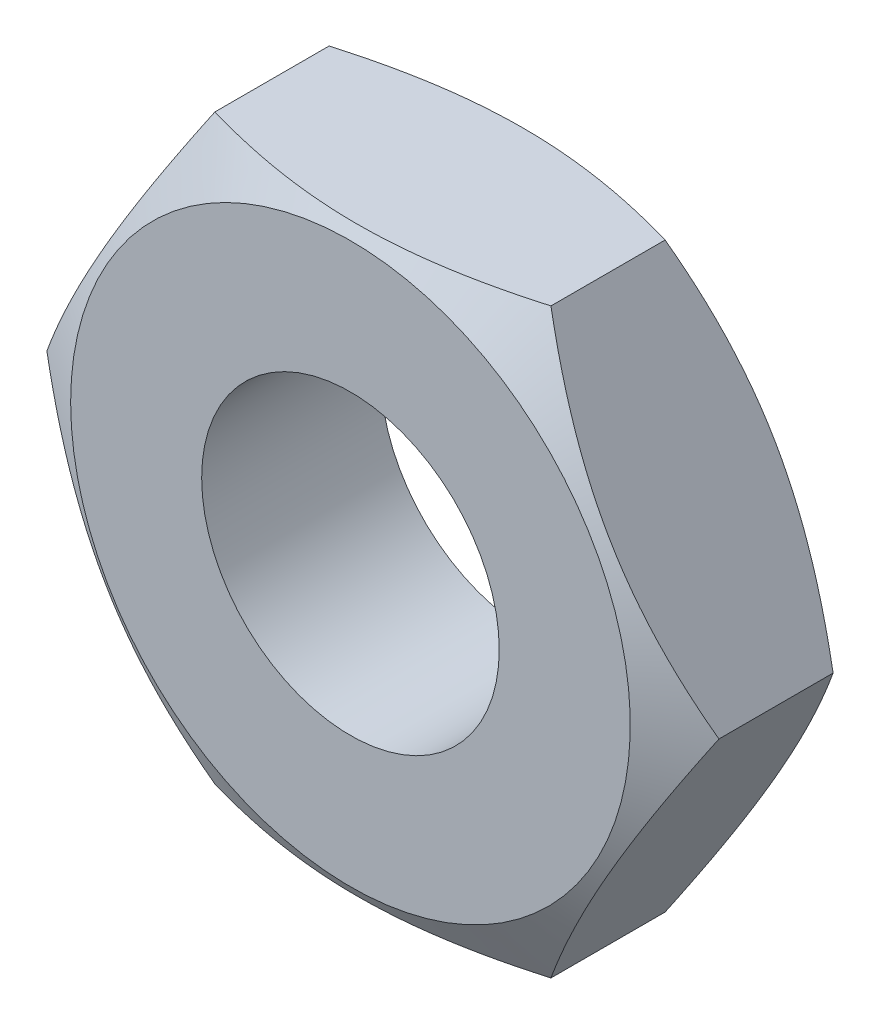
ISO-10303-21;
HEADER;
FILE_DESCRIPTION(('STEP AP214'),'2;1');
FILE_NAME('part.step','',(''),(''),'','','');
FILE_SCHEMA(('AUTOMOTIVE_DESIGN { 1 0 10303 214 1 1 1 1 }'));
ENDSEC;
DATA;
#1=APPLICATION_CONTEXT('core data for automotive mechanical design processes');
#2=APPLICATION_PROTOCOL_DEFINITION('international standard','automotive_design',2000,#1);
#3=PRODUCT_CONTEXT('',#1,'mechanical');
#4=PRODUCT('Part','Part','',(#3));
#5=PRODUCT_RELATED_PRODUCT_CATEGORY('part','',(#4));
#6=PRODUCT_DEFINITION_FORMATION('','',#4);
#7=PRODUCT_DEFINITION_CONTEXT('part definition',#1,'design');
#8=PRODUCT_DEFINITION('design','',#6,#7);
#9=PRODUCT_DEFINITION_SHAPE('','',#8);
#10=(LENGTH_UNIT() NAMED_UNIT(*) SI_UNIT(.MILLI.,.METRE.));
#11=(NAMED_UNIT(*) PLANE_ANGLE_UNIT() SI_UNIT($,.RADIAN.));
#12=(NAMED_UNIT(*) SI_UNIT($,.STERADIAN.) SOLID_ANGLE_UNIT());
#13=UNCERTAINTY_MEASURE_WITH_UNIT(LENGTH_MEASURE(1.E-05),#10,'distance_accuracy_value','');
#14=(GEOMETRIC_REPRESENTATION_CONTEXT(3) GLOBAL_UNCERTAINTY_ASSIGNED_CONTEXT((#13)) GLOBAL_UNIT_ASSIGNED_CONTEXT((#10,
#11,#12)) REPRESENTATION_CONTEXT('',''));
#15=CARTESIAN_POINT('',(0.,0.,0.));
#16=DIRECTION('',(0.,0.,1.));
#17=DIRECTION('',(1.,0.,0.));
#18=AXIS2_PLACEMENT_3D('',#15,#16,#17);
#19=CARTESIAN_POINT('',(-3.75277674973259,-6.5,3.99999999999992));
#20=DIRECTION('',(-0.866025403784438,-0.500000000000001,0.));
#21=DIRECTION('',(0.500000000000001,-0.866025403784438,0.));
#22=AXIS2_PLACEMENT_3D('',#19,#20,#21);
#23=PLANE('',#22);
#24=DIRECTION('',(0.,0.,-1.));
#25=VECTOR('',#24,1.);
#26=CARTESIAN_POINT('',(-3.75277674973259,-6.5,3.99999999999992));
#27=LINE('',#26,#25);
#28=CARTESIAN_POINT('',(-3.75277674973261,-6.5,3.27510584910175));
#29=VERTEX_POINT('',#28);
#30=CARTESIAN_POINT('',(-3.7527767497326,-6.50000000000001,0.724894150898089));
#31=VERTEX_POINT('',#30);
#32=EDGE_CURVE('E11',#29,#31,#27,.T.);
#33=ORIENTED_EDGE('',*,*,#32,.F.);
#34=CARTESIAN_POINT('',(-3.75266127967874,-6.5002,3.27503918089665));
#35=CARTESIAN_POINT('',(-3.83515161912751,-6.35732254094113,3.32265800962708));
#36=CARTESIAN_POINT('',(-3.91794952254313,-6.2139123654651,3.36811573209988));
#37=CARTESIAN_POINT('',(-4.08421773795795,-5.92592736868282,3.45411375067955));
#38=CARTESIAN_POINT('',(-4.16768832359106,-5.78135207342875,3.49465192547457));
#39=CARTESIAN_POINT('',(-4.41943655294053,-5.34531134947998,3.60809143157938));
#40=CARTESIAN_POINT('',(-4.58870793403691,-5.05212471715369,3.67261462557385));
#41=CARTESIAN_POINT('',(-4.84201947708217,-4.61337625445564,3.7482758491551));
#42=CARTESIAN_POINT('',(-4.92530276780317,-4.46912536350532,3.7698295762456));
#43=CARTESIAN_POINT('',(-5.09224566542478,-4.17997178286192,3.80597211809647));
#44=CARTESIAN_POINT('',(-5.17590523841629,-4.03506915190112,3.82056154824292));
#45=CARTESIAN_POINT('',(-5.34336968579965,-3.74501222057169,3.84240368019524));
#46=CARTESIAN_POINT('',(-5.42717428667602,-3.5998583939458,3.84966470838048));
#47=CARTESIAN_POINT('',(-5.59485627940485,-3.30942466302506,3.85670213012036));
#48=CARTESIAN_POINT('',(-5.67873366892861,-3.16414476276365,3.85647875489039));
#49=CARTESIAN_POINT('',(-5.90853103021318,-2.76612405757351,3.84557897418743));
#50=CARTESIAN_POINT('',(-6.05437578112765,-2.51351353897244,3.82728061483318));
#51=CARTESIAN_POINT('',(-6.34509659313137,-2.00997032176433,3.76925609124491));
#52=CARTESIAN_POINT('',(-6.48997163178547,-1.75903939406693,3.72951009416434));
#53=CARTESIAN_POINT('',(-6.78127752911041,-1.25448277935568,3.63015652950044));
#54=CARTESIAN_POINT('',(-6.9276716300707,-1.00092075856409,3.57012800706456));
#55=CARTESIAN_POINT('',(-7.21827667013279,-0.49757806424096,3.43388744019272));
#56=CARTESIAN_POINT('',(-7.36249133098591,-0.247790944447039,3.35770739853899));
#57=CARTESIAN_POINT('',(-7.50566896951899,0.000200000000002282,3.27503918089672));
#58=B_SPLINE_CURVE_WITH_KNOTS('',3,(#34,#35,#36,#37,#38,#39,#40,#41,#42,#43,#44,#45,#46,#47,#48,
#49,#50,#51,#52,#53,#54,#55,#56,#57),.UNSPECIFIED.,.F.,.F.,(4,2,2,2,2,2,2,2,2,2,2,4),(0.,
0.515105052395591,1.03043143507525,2.06322554824264,2.56697389547998,3.07067772176455,
3.57380860368929,4.07692394242522,4.95279354705662,5.82947446853468,6.72559912449738,
7.61996451221048),.UNSPECIFIED.);
#59=CARTESIAN_POINT('',(-7.50555349946515,0.,3.27510584910183));
#60=VERTEX_POINT('',#59);
#61=EDGE_CURVE('E87',#29,#60,#58,.T.);
#62=ORIENTED_EDGE('',*,*,#61,.T.);
#63=DIRECTION('',(0.,0.,-1.));
#64=VECTOR('',#63,1.);
#65=CARTESIAN_POINT('',(-7.50555349946515,0.,4.));
#66=LINE('',#65,#64);
#67=CARTESIAN_POINT('',(-7.50555349946515,0.,0.724894150898173));
#68=VERTEX_POINT('',#67);
#69=EDGE_CURVE('E36',#60,#68,#66,.T.);
#70=ORIENTED_EDGE('',*,*,#69,.T.);
#71=CARTESIAN_POINT('',(-7.50566896951899,0.000200000000007486,0.724960819103282));
#72=CARTESIAN_POINT('',(-7.42317863007023,-0.142677459058876,0.677341990372902));
#73=CARTESIAN_POINT('',(-7.34038072665461,-0.28608763453491,0.631884267900123));
#74=CARTESIAN_POINT('',(-7.17411251123979,-0.574072631317193,0.545886249320464));
#75=CARTESIAN_POINT('',(-7.09064192560668,-0.718647926571262,0.505348074525443));
#76=CARTESIAN_POINT('',(-6.83889369625722,-1.15468865052003,0.391908568420626));
#77=CARTESIAN_POINT('',(-6.66962231516083,-1.44787528284632,0.327385374426157));
#78=CARTESIAN_POINT('',(-6.41631077211558,-1.88662374554437,0.251724150844909));
#79=CARTESIAN_POINT('',(-6.33302748139457,-2.03087463649469,0.230170423754405));
#80=CARTESIAN_POINT('',(-6.16608458377295,-2.32002821713809,0.194027881903536));
#81=CARTESIAN_POINT('',(-6.08242501078145,-2.46493084809889,0.179438451757083));
#82=CARTESIAN_POINT('',(-5.91496056339809,-2.75498777942832,0.157596319804763));
#83=CARTESIAN_POINT('',(-5.83115596252172,-2.90014160605422,0.150335291619525));
#84=CARTESIAN_POINT('',(-5.66347396979289,-3.19057533697496,0.143297869879646));
#85=CARTESIAN_POINT('',(-5.57959658026912,-3.33585523723636,0.143521245109616));
#86=CARTESIAN_POINT('',(-5.34979921898455,-3.7338759424265,0.154421025812574));
#87=CARTESIAN_POINT('',(-5.20395446807009,-3.98648646102757,0.172719385166826));
#88=CARTESIAN_POINT('',(-4.91323365606638,-4.49002967823568,0.230743908755089));
#89=CARTESIAN_POINT('',(-4.76835861741228,-4.74096060593308,0.270489905835654));
#90=CARTESIAN_POINT('',(-4.47705272008734,-5.24551722064432,0.36984347049956));
#91=CARTESIAN_POINT('',(-4.33065861912705,-5.49907924143591,0.429871992935442));
#92=CARTESIAN_POINT('',(-4.04005357906495,-6.00242193575904,0.566112559807265));
#93=CARTESIAN_POINT('',(-3.89583891821183,-6.25220905555296,0.642292601460966));
#94=CARTESIAN_POINT('',(-3.75266127967873,-6.5002,0.724960819103185));
#95=B_SPLINE_CURVE_WITH_KNOTS('',3,(#71,#72,#73,#74,#75,#76,#77,#78,#79,#80,#81,#82,#83,#84,#85,
#86,#87,#88,#89,#90,#91,#92,#93,#94),.UNSPECIFIED.,.F.,.F.,(4,2,2,2,2,2,2,2,2,2,2,4),(0.,
0.515105052395587,1.03043143507524,2.06322554824263,2.56697389547997,3.07067772176455,
3.57380860368929,4.07692394242521,4.95279354705661,5.82947446853467,6.72559912449736,
7.61996451221045),.UNSPECIFIED.);
#96=EDGE_CURVE('E110',#68,#31,#95,.T.);
#97=ORIENTED_EDGE('',*,*,#96,.T.);
#98=EDGE_LOOP('',(#33,#62,#70,#97));
#99=FACE_BOUND('',#98,.T.);
#100=ADVANCED_FACE('F32',(#99),#23,.T.);
#101=CARTESIAN_POINT('',(3.75277674973257,-6.5,4.));
#102=DIRECTION('',(0.,-1.,0.));
#103=DIRECTION('',(0.,0.,-1.));
#104=AXIS2_PLACEMENT_3D('',#101,#102,#103);
#105=PLANE('',#104);
#106=DIRECTION('',(0.,0.,-1.));
#107=VECTOR('',#106,1.);
#108=CARTESIAN_POINT('',(3.75277674973257,-6.5,4.));
#109=LINE('',#108,#107);
#110=CARTESIAN_POINT('',(3.75277674973256,-6.50000000000002,3.27510584910183));
#111=VERTEX_POINT('',#110);
#112=CARTESIAN_POINT('',(3.75277674973256,-6.50000000000003,0.724894150898173));
#113=VERTEX_POINT('',#112);
#114=EDGE_CURVE('E41',#111,#113,#109,.T.);
#115=ORIENTED_EDGE('',*,*,#114,.F.);
#116=CARTESIAN_POINT('',(-9.9329111139939,-6.5,0.754906682123066));
#117=CARTESIAN_POINT('',(-9.64767955039306,-6.5,0.892663122181242));
#118=CARTESIAN_POINT('',(-9.36177133340941,-6.5,1.02904400270684));
#119=CARTESIAN_POINT('',(-8.78823564087502,-6.5,1.29826812963095));
#120=CARTESIAN_POINT('',(-8.50060787599527,-6.5,1.43111075893201));
#121=CARTESIAN_POINT('',(-7.9217034658278,-6.5,1.69317607593003));
#122=CARTESIAN_POINT('',(-7.63041534596979,-6.5,1.82237350815588));
#123=CARTESIAN_POINT('',(-7.04543753790207,-6.5,2.07519012674291));
#124=CARTESIAN_POINT('',(-6.75174797646856,-6.5,2.19880960535652));
#125=CARTESIAN_POINT('',(-6.15794764754986,-6.5,2.44041567436682));
#126=CARTESIAN_POINT('',(-5.85780209090147,-6.5,2.55831723211062));
#127=CARTESIAN_POINT('',(-5.25396342793671,-6.5,2.78483618655303));
#128=CARTESIAN_POINT('',(-4.95026993066044,-6.5,2.89345254890333));
#129=CARTESIAN_POINT('',(-4.33948377050504,-6.5,3.09846829958749));
#130=CARTESIAN_POINT('',(-4.0323999742936,-6.5,3.19489383758258));
#131=CARTESIAN_POINT('',(-3.41386453476734,-6.5,3.37238231884675));
#132=CARTESIAN_POINT('',(-3.10241431094499,-6.5,3.45345013587113));
#133=CARTESIAN_POINT('',(-2.47494029352132,-6.5,3.59628094206166));
#134=CARTESIAN_POINT('',(-2.15891506480612,-6.5,3.65803773005163));
#135=CARTESIAN_POINT('',(-1.5230327464652,-6.5,3.75805563902527));
#136=CARTESIAN_POINT('',(-1.20317564973267,-6.5,3.79631671642553));
#137=CARTESIAN_POINT('',(-0.722892860804688,-6.5,3.83363342159267));
#138=CARTESIAN_POINT('',(-0.563206443347288,-6.5,3.84272902235532));
#139=CARTESIAN_POINT('',(-0.24358480431845,-6.5,3.85415572292366));
#140=CARTESIAN_POINT('',(-0.0836495865185665,-6.5,3.85648692428988));
#141=CARTESIAN_POINT('',(0.236128769735196,-6.5,3.85432167663096));
#142=CARTESIAN_POINT('',(0.395971921427853,-6.5,3.84982712805694));
#143=CARTESIAN_POINT('',(0.715330785773319,-6.5,3.83412365838044));
#144=CARTESIAN_POINT('',(0.874846480355585,-6.5,3.82291437622007));
#145=CARTESIAN_POINT('',(1.26198993509598,-6.5,3.787793286803));
#146=CARTESIAN_POINT('',(1.48931571071905,-6.5,3.76048778077119));
#147=CARTESIAN_POINT('',(1.94217299466154,-6.5,3.69376399429845));
#148=CARTESIAN_POINT('',(2.16770422901665,-6.5,3.65434389944443));
#149=CARTESIAN_POINT('',(2.84200611808105,-6.5,3.51989020814479));
#150=CARTESIAN_POINT('',(3.28760230765346,-6.5,3.40875343644009));
#151=CARTESIAN_POINT('',(3.95410051775723,-6.5,3.21728873517789));
#152=CARTESIAN_POINT('',(4.17848908923235,-6.5,3.14841043008937));
#153=CARTESIAN_POINT('',(4.62509856435045,-6.5,3.00382682081051));
#154=CARTESIAN_POINT('',(4.84731927125519,-6.5,2.92812090327104));
#155=CARTESIAN_POINT('',(5.28848357156534,-6.5,2.77150122140703));
#156=CARTESIAN_POINT('',(5.50743858802282,-6.5,2.6906193076524));
#157=CARTESIAN_POINT('',(5.94348794783137,-6.5,2.52419729743006));
#158=CARTESIAN_POINT('',(6.16058290820355,-6.5,2.43865882083369));
#159=CARTESIAN_POINT('',(6.37689512702089,-6.5,2.35122853225757));
#160=B_SPLINE_CURVE_WITH_KNOTS('',3,(#116,#117,#118,#119,#120,#121,#122,#123,#124,#125,#126,
#127,#128,#129,#130,#131,#132,#133,#134,#135,#136,#137,#138,#139,#140,#141,#142,#143,#144,#145,
#146,#147,#148,#149,#150,#151,#152,#153,#154,#155,#156,#157,#158,#159),.UNSPECIFIED.,.F.,.F.,(4,
2,2,2,2,2,2,2,2,2,2,2,2,2,2,2,2,2,2,2,2,4),(0.,0.950278588424254,1.90072184145586,
2.8566391323511,3.81250628042663,4.77980343869425,5.74720821148913,6.71250133597993,
7.67748761074123,8.64278344534724,9.60808107052472,10.0877950648643,10.5675018567521,
11.0470751113439,11.5266741553803,12.2131633142699,12.8997553394188,14.2755893174374,
14.9797013551423,15.6838767089079,16.3840723670879,17.0840259867149),.UNSPECIFIED.);
#161=EDGE_CURVE('E95',#111,#29,#160,.F.);
#162=ORIENTED_EDGE('',*,*,#161,.T.);
#163=ORIENTED_EDGE('',*,*,#32,.T.);
#164=CARTESIAN_POINT('',(-9.9329111139939,-6.5,3.24509331787691));
#165=CARTESIAN_POINT('',(-9.64767955039306,-6.5,3.10733687781875));
#166=CARTESIAN_POINT('',(-9.36177133340941,-6.5,2.97095599729316));
#167=CARTESIAN_POINT('',(-8.78823564087502,-6.5,2.70173187036905));
#168=CARTESIAN_POINT('',(-8.50060787599527,-6.5,2.568889241068));
#169=CARTESIAN_POINT('',(-7.9217034658278,-6.5,2.30682392406997));
#170=CARTESIAN_POINT('',(-7.63041534596979,-6.5,2.17762649184412));
#171=CARTESIAN_POINT('',(-7.04543753790205,-6.5,1.92480987325708));
#172=CARTESIAN_POINT('',(-6.75174797646854,-6.5,1.80119039464347));
#173=CARTESIAN_POINT('',(-6.15794764754983,-6.5,1.55958432563318));
#174=CARTESIAN_POINT('',(-5.85780209090143,-6.5,1.44168276788937));
#175=CARTESIAN_POINT('',(-5.25396342793667,-6.5,1.21516381344696));
#176=CARTESIAN_POINT('',(-4.95026993066039,-6.5,1.10654745109664));
#177=CARTESIAN_POINT('',(-4.33948377050498,-6.5,0.901531700412507));
#178=CARTESIAN_POINT('',(-4.03239997429353,-6.5,0.805106162417445));
#179=CARTESIAN_POINT('',(-3.4138645347673,-6.5,0.627617681153193));
#180=CARTESIAN_POINT('',(-3.10241431094498,-6.5,0.546549864128702));
#181=CARTESIAN_POINT('',(-2.47494029352132,-6.5,0.403719057938181));
#182=CARTESIAN_POINT('',(-2.1589150648061,-6.5,0.341962269948328));
#183=CARTESIAN_POINT('',(-1.52303274646517,-6.5,0.241944360974772));
#184=CARTESIAN_POINT('',(-1.20317564973265,-6.5,0.203683283574472));
#185=CARTESIAN_POINT('',(-0.722892860804671,-6.5,0.166366578407327));
#186=CARTESIAN_POINT('',(-0.563206443347272,-6.5,0.157270977644687));
#187=CARTESIAN_POINT('',(-0.243584804318435,-6.5,0.145844277076346));
#188=CARTESIAN_POINT('',(-0.0836495865185516,-6.5,0.143513075710113));
#189=CARTESIAN_POINT('',(0.236128769735205,-6.5,0.145678323369055));
#190=CARTESIAN_POINT('',(0.395971921427858,-6.5,0.150172871943103));
#191=CARTESIAN_POINT('',(0.715330785773321,-6.5,0.165876341619525));
#192=CARTESIAN_POINT('',(0.87484648035559,-6.5,0.177085623779787));
#193=CARTESIAN_POINT('',(1.26198993509598,-6.5,0.212206713196808));
#194=CARTESIAN_POINT('',(1.48931571071902,-6.5,0.239512219228753));
#195=CARTESIAN_POINT('',(1.9421729946615,-6.5,0.3062360057016));
#196=CARTESIAN_POINT('',(2.16770422901661,-6.5,0.345656100555586));
#197=CARTESIAN_POINT('',(2.84200611808103,-6.5,0.480109791855165));
#198=CARTESIAN_POINT('',(3.28760230765343,-6.5,0.591246563559895));
#199=CARTESIAN_POINT('',(3.95410051775721,-6.5,0.782711264822107));
#200=CARTESIAN_POINT('',(4.17848908923234,-6.5,0.851589569910637));
#201=CARTESIAN_POINT('',(4.62509856435045,-6.5,0.99617317918949));
#202=CARTESIAN_POINT('',(4.8473192712552,-6.5,1.07187909672897));
#203=CARTESIAN_POINT('',(5.28848357156535,-6.5,1.22849877859298));
#204=CARTESIAN_POINT('',(5.50743858802283,-6.5,1.3093806923476));
#205=CARTESIAN_POINT('',(5.94348794783137,-6.5,1.47580270256994));
#206=CARTESIAN_POINT('',(6.16058290820356,-6.5,1.56134117916632));
#207=CARTESIAN_POINT('',(6.37689512702089,-6.5,1.64877146774244));
#208=B_SPLINE_CURVE_WITH_KNOTS('',3,(#164,#165,#166,#167,#168,#169,#170,#171,#172,#173,#174,
#175,#176,#177,#178,#179,#180,#181,#182,#183,#184,#185,#186,#187,#188,#189,#190,#191,#192,#193,
#194,#195,#196,#197,#198,#199,#200,#201,#202,#203,#204,#205,#206,#207),.UNSPECIFIED.,.F.,.F.,(4,
2,2,2,2,2,2,2,2,2,2,2,2,2,2,2,2,2,2,2,2,4),(0.,0.950278588424241,1.90072184145584,
2.8566391323511,3.81250628042664,4.77980343869428,5.74720821148918,6.71250133597998,
7.67748761074127,8.64278344534726,9.60808107052474,10.0877950648644,10.5675018567522,
11.0470751113439,11.5266741553803,12.2131633142698,12.8997553394188,14.2755893174374,
14.9797013551424,15.6838767089079,16.3840723670879,17.0840259867149),.UNSPECIFIED.);
#209=EDGE_CURVE('E138',#31,#113,#208,.T.);
#210=ORIENTED_EDGE('',*,*,#209,.T.);
#211=EDGE_LOOP('',(#115,#162,#163,#210));
#212=FACE_BOUND('',#211,.T.);
#213=ADVANCED_FACE('F180',(#212),#105,.T.);
#214=CARTESIAN_POINT('',(7.50555349946515,0.,4.));
#215=DIRECTION('',(0.866025403784438,-0.500000000000001,0.));
#216=DIRECTION('',(0.500000000000001,0.866025403784438,0.));
#217=AXIS2_PLACEMENT_3D('',#214,#215,#216);
#218=PLANE('',#217);
#219=DIRECTION('',(0.,0.,-1.));
#220=VECTOR('',#219,1.);
#221=CARTESIAN_POINT('',(7.50555349946515,0.,4.));
#222=LINE('',#221,#220);
#223=CARTESIAN_POINT('',(7.50555349946515,0.,3.27510584910183));
#224=VERTEX_POINT('',#223);
#225=CARTESIAN_POINT('',(7.50555349946515,0.,0.724894150898173));
#226=VERTEX_POINT('',#225);
#227=EDGE_CURVE('E115',#224,#226,#222,.T.);
#228=ORIENTED_EDGE('',*,*,#227,.F.);
#229=CARTESIAN_POINT('',(7.50566896951899,0.000199999999998812,3.27503918089672));
#230=CARTESIAN_POINT('',(7.42317863007022,-0.142677459058881,3.32265800962711));
#231=CARTESIAN_POINT('',(7.3403807266546,-0.286087634534913,3.36811573209989));
#232=CARTESIAN_POINT('',(7.17411251123977,-0.574072631317195,3.45411375067955));
#233=CARTESIAN_POINT('',(7.09064192560667,-0.718647926571264,3.49465192547457));
#234=CARTESIAN_POINT('',(6.8388936962572,-1.15468865052003,3.60809143157938));
#235=CARTESIAN_POINT('',(6.66962231516082,-1.44787528284632,3.67261462557385));
#236=CARTESIAN_POINT('',(6.41631077211556,-1.88662374554438,3.7482758491551));
#237=CARTESIAN_POINT('',(6.33302748139455,-2.03087463649469,3.76982957624561));
#238=CARTESIAN_POINT('',(6.16608458377294,-2.32002821713809,3.80597211809647));
#239=CARTESIAN_POINT('',(6.08242501078144,-2.46493084809889,3.82056154824293));
#240=CARTESIAN_POINT('',(5.91496056339808,-2.75498777942832,3.84240368019525));
#241=CARTESIAN_POINT('',(5.83115596252172,-2.90014160605422,3.84966470838049));
#242=CARTESIAN_POINT('',(5.66347396979288,-3.19057533697495,3.85670213012036));
#243=CARTESIAN_POINT('',(5.57959658026911,-3.33585523723636,3.85647875489039));
#244=CARTESIAN_POINT('',(5.34979921898453,-3.73387594242649,3.84557897418743));
#245=CARTESIAN_POINT('',(5.20395446807007,-3.98648646102757,3.82728061483318));
#246=CARTESIAN_POINT('',(4.91323365606637,-4.49002967823568,3.76925609124492));
#247=CARTESIAN_POINT('',(4.76835861741227,-4.74096060593309,3.72951009416435));
#248=CARTESIAN_POINT('',(4.47705272008732,-5.24551722064432,3.63015652950045));
#249=CARTESIAN_POINT('',(4.33065861912703,-5.49907924143591,3.57012800706457));
#250=CARTESIAN_POINT('',(4.04005357906494,-6.00242193575904,3.43388744019273));
#251=CARTESIAN_POINT('',(3.89583891821182,-6.25220905555296,3.35770739853901));
#252=CARTESIAN_POINT('',(3.75266127967873,-6.5002,3.27503918089674));
#253=B_SPLINE_CURVE_WITH_KNOTS('',3,(#229,#230,#231,#232,#233,#234,#235,#236,#237,#238,#239,
#240,#241,#242,#243,#244,#245,#246,#247,#248,#249,#250,#251,#252),.UNSPECIFIED.,.F.,.F.,(4,2,2,
2,2,2,2,2,2,2,2,4),(0.,0.515105052395588,1.03043143507525,2.06322554824263,2.56697389547997,
3.07067772176454,3.57380860368929,4.07692394242521,4.95279354705661,5.82947446853467,
6.72559912449737,7.61996451221046),.UNSPECIFIED.);
#254=EDGE_CURVE('E194',#224,#111,#253,.T.);
#255=ORIENTED_EDGE('',*,*,#254,.T.);
#256=ORIENTED_EDGE('',*,*,#114,.T.);
#257=CARTESIAN_POINT('',(3.75266127967874,-6.5002,0.724960819103268));
#258=CARTESIAN_POINT('',(3.83515161912751,-6.35732254094112,0.677341990372887));
#259=CARTESIAN_POINT('',(3.91794952254313,-6.21391236546509,0.631884267900108));
#260=CARTESIAN_POINT('',(4.08421773795795,-5.92592736868281,0.545886249320449));
#261=CARTESIAN_POINT('',(4.16768832359106,-5.78135207342874,0.505348074525429));
#262=CARTESIAN_POINT('',(4.41943655294052,-5.34531134947997,0.391908568420614));
#263=CARTESIAN_POINT('',(4.5887079340369,-5.05212471715368,0.327385374426146));
#264=CARTESIAN_POINT('',(4.84201947708216,-4.61337625445563,0.2517241508449));
#265=CARTESIAN_POINT('',(4.92530276780317,-4.46912536350532,0.230170423754396));
#266=CARTESIAN_POINT('',(5.09224566542478,-4.17997178286192,0.194027881903528));
#267=CARTESIAN_POINT('',(5.17590523841628,-4.03506915190112,0.179438451757076));
#268=CARTESIAN_POINT('',(5.34336968579964,-3.74501222057169,0.157596319804757));
#269=CARTESIAN_POINT('',(5.42717428667601,-3.5998583939458,0.150335291619518));
#270=CARTESIAN_POINT('',(5.59485627940484,-3.30942466302506,0.143297869879642));
#271=CARTESIAN_POINT('',(5.67873366892859,-3.16414476276364,0.143521245109615));
#272=CARTESIAN_POINT('',(5.90853103021315,-2.7661240575735,0.154421025812575));
#273=CARTESIAN_POINT('',(6.05437578112764,-2.51351353897243,0.172719385166823));
#274=CARTESIAN_POINT('',(6.34509659313136,-2.00997032176433,0.230743908755086));
#275=CARTESIAN_POINT('',(6.48997163178546,-1.75903939406692,0.270489905835656));
#276=CARTESIAN_POINT('',(6.7812775291104,-1.25448277935568,0.36984347049956));
#277=CARTESIAN_POINT('',(6.92767163007069,-1.00092075856409,0.429871992935436));
#278=CARTESIAN_POINT('',(7.21827667013278,-0.497578064240957,0.566112559807278));
#279=CARTESIAN_POINT('',(7.36249133098591,-0.247790944447039,0.642292601461004));
#280=CARTESIAN_POINT('',(7.50566896951899,0.000199999999998812,0.724960819103282));
#281=B_SPLINE_CURVE_WITH_KNOTS('',3,(#257,#258,#259,#260,#261,#262,#263,#264,#265,#266,#267,
#268,#269,#270,#271,#272,#273,#274,#275,#276,#277,#278,#279,#280),.UNSPECIFIED.,.F.,.F.,(4,2,2,
2,2,2,2,2,2,2,2,4),(0.,0.515105052395587,1.03043143507524,2.06322554824262,2.56697389547996,
3.07067772176453,3.57380860368927,4.07692394242519,4.95279354705659,5.82947446853466,
6.72559912449736,7.61996451221046),.UNSPECIFIED.);
#282=EDGE_CURVE('E136',#113,#226,#281,.T.);
#283=ORIENTED_EDGE('',*,*,#282,.T.);
#284=EDGE_LOOP('',(#228,#255,#256,#283));
#285=FACE_BOUND('',#284,.T.);
#286=ADVANCED_FACE('F184',(#285),#218,.T.);
#287=CARTESIAN_POINT('',(3.75277674973257,6.50000000000001,4.));
#288=DIRECTION('',(0.866025403784438,0.500000000000001,0.));
#289=DIRECTION('',(-0.500000000000001,0.866025403784438,0.));
#290=AXIS2_PLACEMENT_3D('',#287,#288,#289);
#291=PLANE('',#290);
#292=DIRECTION('',(0.,0.,-1.));
#293=VECTOR('',#292,1.);
#294=CARTESIAN_POINT('',(3.75277674973257,6.50000000000001,4.));
#295=LINE('',#294,#293);
#296=CARTESIAN_POINT('',(3.7527767497326,6.5,3.27510584910183));
#297=VERTEX_POINT('',#296);
#298=CARTESIAN_POINT('',(3.7527767497326,6.5,0.724894150898173));
#299=VERTEX_POINT('',#298);
#300=EDGE_CURVE('E103',#297,#299,#295,.T.);
#301=ORIENTED_EDGE('',*,*,#300,.F.);
#302=CARTESIAN_POINT('',(3.75266127967873,6.5002,3.27503918089674));
#303=CARTESIAN_POINT('',(3.83515161912751,6.35732254094112,3.32265800962712));
#304=CARTESIAN_POINT('',(3.91794952254313,6.21391236546509,3.36811573209989));
#305=CARTESIAN_POINT('',(4.08421773795795,5.92592736868281,3.45411375067955));
#306=CARTESIAN_POINT('',(4.16768832359106,5.78135207342874,3.49465192547457));
#307=CARTESIAN_POINT('',(4.41943655294052,5.34531134947997,3.60809143157939));
#308=CARTESIAN_POINT('',(4.5887079340369,5.05212471715368,3.67261462557386));
#309=CARTESIAN_POINT('',(4.84201947708216,4.61337625445563,3.7482758491551));
#310=CARTESIAN_POINT('',(4.92530276780317,4.46912536350531,3.76982957624561));
#311=CARTESIAN_POINT('',(5.09224566542478,4.17997178286191,3.80597211809648));
#312=CARTESIAN_POINT('',(5.17590523841628,4.03506915190112,3.82056154824293));
#313=CARTESIAN_POINT('',(5.34336968579965,3.74501222057168,3.84240368019525));
#314=CARTESIAN_POINT('',(5.42717428667601,3.59985839394579,3.84966470838049));
#315=CARTESIAN_POINT('',(5.59485627940485,3.30942466302506,3.85670213012036));
#316=CARTESIAN_POINT('',(5.67873366892861,3.16414476276365,3.85647875489039));
#317=CARTESIAN_POINT('',(5.90853103021318,2.76612405757351,3.84557897418743));
#318=CARTESIAN_POINT('',(6.05437578112765,2.51351353897243,3.82728061483318));
#319=CARTESIAN_POINT('',(6.34509659313136,2.00997032176432,3.76925609124492));
#320=CARTESIAN_POINT('',(6.48997163178546,1.75903939406692,3.72951009416435));
#321=CARTESIAN_POINT('',(6.7812775291104,1.25448277935568,3.63015652950044));
#322=CARTESIAN_POINT('',(6.92767163007069,1.00092075856409,3.57012800706457));
#323=CARTESIAN_POINT('',(7.21827667013279,0.497578064240956,3.43388744019272));
#324=CARTESIAN_POINT('',(7.36249133098591,0.247790944447036,3.357707398539));
#325=CARTESIAN_POINT('',(7.50566896951899,-0.000200000000002282,3.27503918089672));
#326=B_SPLINE_CURVE_WITH_KNOTS('',3,(#302,#303,#304,#305,#306,#307,#308,#309,#310,#311,#312,
#313,#314,#315,#316,#317,#318,#319,#320,#321,#322,#323,#324,#325),.UNSPECIFIED.,.F.,.F.,(4,2,2,
2,2,2,2,2,2,2,2,4),(0.,0.515105052395587,1.03043143507524,2.06322554824262,2.56697389547996,
3.07067772176453,3.57380860368927,4.0769239424252,4.9527935470566,5.82947446853466,
6.72559912449737,7.61996451221046),.UNSPECIFIED.);
#327=EDGE_CURVE('E297',#297,#224,#326,.T.);
#328=ORIENTED_EDGE('',*,*,#327,.T.);
#329=ORIENTED_EDGE('',*,*,#227,.T.);
#330=CARTESIAN_POINT('',(7.50566896951899,-0.000200000000000547,0.724960819103282));
#331=CARTESIAN_POINT('',(7.42317863007022,0.142677459058881,0.677341990372898));
#332=CARTESIAN_POINT('',(7.3403807266546,0.286087634534914,0.631884267900118));
#333=CARTESIAN_POINT('',(7.17411251123977,0.574072631317197,0.545886249320456));
#334=CARTESIAN_POINT('',(7.09064192560667,0.718647926571267,0.505348074525436));
#335=CARTESIAN_POINT('',(6.8388936962572,1.15468865052004,0.39190856842062));
#336=CARTESIAN_POINT('',(6.66962231516082,1.44787528284632,0.327385374426151));
#337=CARTESIAN_POINT('',(6.41631077211556,1.88662374554438,0.251724150844903));
#338=CARTESIAN_POINT('',(6.33302748139455,2.0308746364947,0.230170423754399));
#339=CARTESIAN_POINT('',(6.16608458377294,2.32002821713809,0.194027881903531));
#340=CARTESIAN_POINT('',(6.08242501078144,2.4649308480989,0.179438451757078));
#341=CARTESIAN_POINT('',(5.91496056339808,2.75498777942833,0.157596319804758));
#342=CARTESIAN_POINT('',(5.83115596252171,2.90014160605422,0.150335291619519));
#343=CARTESIAN_POINT('',(5.66347396979288,3.19057533697496,0.143297869879642));
#344=CARTESIAN_POINT('',(5.57959658026911,3.33585523723636,0.143521245109615));
#345=CARTESIAN_POINT('',(5.34979921898453,3.7338759424265,0.154421025812575));
#346=CARTESIAN_POINT('',(5.20395446807007,3.98648646102758,0.172719385166823));
#347=CARTESIAN_POINT('',(4.91323365606637,4.49002967823569,0.230743908755084));
#348=CARTESIAN_POINT('',(4.76835861741227,4.74096060593309,0.270489905835653));
#349=CARTESIAN_POINT('',(4.47705272008733,5.24551722064433,0.369843470499556));
#350=CARTESIAN_POINT('',(4.33065861912703,5.49907924143592,0.429871992935432));
#351=CARTESIAN_POINT('',(4.04005357906494,6.00242193575905,0.566112559807272));
#352=CARTESIAN_POINT('',(3.89583891821182,6.25220905555296,0.642292601460995));
#353=CARTESIAN_POINT('',(3.75266127967873,6.5002,0.724960819103268));
#354=B_SPLINE_CURVE_WITH_KNOTS('',3,(#330,#331,#332,#333,#334,#335,#336,#337,#338,#339,#340,
#341,#342,#343,#344,#345,#346,#347,#348,#349,#350,#351,#352,#353),.UNSPECIFIED.,.F.,.F.,(4,2,2,
2,2,2,2,2,2,2,2,4),(0.,0.515105052395589,1.03043143507525,2.06322554824263,2.56697389547997,
3.07067772176455,3.57380860368929,4.07692394242521,4.95279354705661,5.82947446853467,
6.72559912449737,7.61996451221046),.UNSPECIFIED.);
#355=EDGE_CURVE('E131',#226,#299,#354,.T.);
#356=ORIENTED_EDGE('',*,*,#355,.T.);
#357=EDGE_LOOP('',(#301,#328,#329,#356));
#358=FACE_BOUND('',#357,.T.);
#359=ADVANCED_FACE('F134',(#358),#291,.T.);
#360=CARTESIAN_POINT('',(-3.75277674973258,6.5,4.));
#361=DIRECTION('',(0.,0.999999999999999,0.));
#362=DIRECTION('',(-0.999999999999999,0.,0.));
#363=AXIS2_PLACEMENT_3D('',#360,#361,#362);
#364=PLANE('',#363);
#365=DIRECTION('',(0.,0.,-1.));
#366=VECTOR('',#365,1.);
#367=CARTESIAN_POINT('',(-3.75277674973258,6.5,4.));
#368=LINE('',#367,#366);
#369=CARTESIAN_POINT('',(-3.75277674973258,6.5,3.27510584910183));
#370=VERTEX_POINT('',#369);
#371=CARTESIAN_POINT('',(-3.75277674973256,6.50000000000003,0.724894150898173));
#372=VERTEX_POINT('',#371);
#373=EDGE_CURVE('E101',#370,#372,#368,.T.);
#374=ORIENTED_EDGE('',*,*,#373,.F.);
#375=CARTESIAN_POINT('',(-9.93291111399521,6.50000000000001,0.754906682122455));
#376=CARTESIAN_POINT('',(-9.64767955039432,6.5,0.892663122180647));
#377=CARTESIAN_POINT('',(-9.36177133341061,6.5,1.02904400270627));
#378=CARTESIAN_POINT('',(-8.78823564087614,6.5,1.29826812963043));
#379=CARTESIAN_POINT('',(-8.50060787599634,6.5,1.43111075893151));
#380=CARTESIAN_POINT('',(-7.92170346582878,6.5,1.69317607592959));
#381=CARTESIAN_POINT('',(-7.63041534597073,6.5,1.82237350815547));
#382=CARTESIAN_POINT('',(-7.0454375379029,6.5,2.07519012674255));
#383=CARTESIAN_POINT('',(-6.75174797646935,6.5,2.19880960535619));
#384=CARTESIAN_POINT('',(-6.15794764755055,6.5,2.44041567436654));
#385=CARTESIAN_POINT('',(-5.85780209090211,6.5,2.55831723211037));
#386=CARTESIAN_POINT('',(-5.25396342793725,6.5,2.78483618655283));
#387=CARTESIAN_POINT('',(-4.95026993066093,6.5,2.89345254890317));
#388=CARTESIAN_POINT('',(-4.33948377050543,6.5,3.09846829958736));
#389=CARTESIAN_POINT('',(-4.03239997429394,6.5,3.19489383758246));
#390=CARTESIAN_POINT('',(-3.4138645347676,6.5,3.37238231884671));
#391=CARTESIAN_POINT('',(-3.10241431094521,6.5,3.45345013587116));
#392=CARTESIAN_POINT('',(-2.47494029352142,6.5,3.59628094206172));
#393=CARTESIAN_POINT('',(-2.15891506480613,6.5,3.65803773005165));
#394=CARTESIAN_POINT('',(-1.52303274646505,6.5,3.75805563902527));
#395=CARTESIAN_POINT('',(-1.20317564973244,6.5,3.79631671642556));
#396=CARTESIAN_POINT('',(-0.722892860804342,6.5,3.8336334215927));
#397=CARTESIAN_POINT('',(-0.563206443346904,6.5,3.84272902235534));
#398=CARTESIAN_POINT('',(-0.243584804317987,6.5,3.85415572292366));
#399=CARTESIAN_POINT('',(-0.0836495865180636,6.5,3.85648692428989));
#400=CARTESIAN_POINT('',(0.236128769735775,6.5,3.85432167663094));
#401=CARTESIAN_POINT('',(0.39597192142847,6.5,3.8498271280569));
#402=CARTESIAN_POINT('',(0.715330785774013,6.5,3.83412365838041));
#403=CARTESIAN_POINT('',(0.874846480356318,6.5,3.82291437622008));
#404=CARTESIAN_POINT('',(1.26198993509677,6.5,3.78779328680299));
#405=CARTESIAN_POINT('',(1.48931571071985,6.5,3.76048778077111));
#406=CARTESIAN_POINT('',(1.94217299466239,6.5,3.69376399429829));
#407=CARTESIAN_POINT('',(2.16770422901752,6.5,3.65434389944426));
#408=CARTESIAN_POINT('',(2.842006118082,6.5,3.51989020814459));
#409=CARTESIAN_POINT('',(3.28760230765444,6.5,3.40875343643984));
#410=CARTESIAN_POINT('',(3.95410051775828,6.5,3.21728873517758));
#411=CARTESIAN_POINT('',(4.17848908923342,6.5,3.14841043008903));
#412=CARTESIAN_POINT('',(4.62509856435158,6.5,3.00382682081014));
#413=CARTESIAN_POINT('',(4.84731927125634,6.5,2.92812090327064));
#414=CARTESIAN_POINT('',(5.28848357156653,6.5,2.77150122140659));
#415=CARTESIAN_POINT('',(5.50743858802403,6.5,2.69061930765195));
#416=CARTESIAN_POINT('',(5.94348794783262,6.5,2.52419729742958));
#417=CARTESIAN_POINT('',(6.16058290820482,6.5,2.43865882083319));
#418=CARTESIAN_POINT('',(6.37689512702218,6.50000000000001,2.35122853225705));
#419=B_SPLINE_CURVE_WITH_KNOTS('',3,(#375,#376,#377,#378,#379,#380,#381,#382,#383,#384,#385,
#386,#387,#388,#389,#390,#391,#392,#393,#394,#395,#396,#397,#398,#399,#400,#401,#402,#403,#404,
#405,#406,#407,#408,#409,#410,#411,#412,#413,#414,#415,#416,#417,#418),.UNSPECIFIED.,.F.,.F.,(4,
2,2,2,2,2,2,2,2,2,2,2,2,2,2,2,2,2,2,2,2,4),(0.,0.950278588424406,1.90072184145616,
2.85663913235157,3.81250628042727,4.77980343869506,5.7472082114901,6.71250133598106,
7.67748761074251,8.64278344534875,9.60808107052647,10.0877950648662,10.5675018567541,
11.047075111346,11.5266741553825,12.2131633142721,12.8997553394212,14.27558931744,
14.979701355145,15.6838767089106,16.3840723670907,17.0840259867177),.UNSPECIFIED.);
#420=EDGE_CURVE('E49',#370,#297,#419,.T.);
#421=ORIENTED_EDGE('',*,*,#420,.T.);
#422=ORIENTED_EDGE('',*,*,#300,.T.);
#423=CARTESIAN_POINT('',(-9.93291111399521,6.5,3.24509331787755));
#424=CARTESIAN_POINT('',(-9.64767955039432,6.5,3.10733687781936));
#425=CARTESIAN_POINT('',(-9.36177133341062,6.5,2.97095599729374));
#426=CARTESIAN_POINT('',(-8.78823564087614,6.5,2.70173187036957));
#427=CARTESIAN_POINT('',(-8.50060787599634,6.5,2.56888924106849));
#428=CARTESIAN_POINT('',(-7.92170346582879,6.5,2.30682392407041));
#429=CARTESIAN_POINT('',(-7.63041534597073,6.5,2.17762649184453));
#430=CARTESIAN_POINT('',(-7.04543753790291,6.5,1.92480987325745));
#431=CARTESIAN_POINT('',(-6.75174797646935,6.5,1.80119039464381));
#432=CARTESIAN_POINT('',(-6.15794764755056,6.5,1.55958432563346));
#433=CARTESIAN_POINT('',(-5.85780209090211,6.5,1.44168276788963));
#434=CARTESIAN_POINT('',(-5.25396342793725,6.5,1.21516381344717));
#435=CARTESIAN_POINT('',(-4.95026993066093,6.5,1.10654745109684));
#436=CARTESIAN_POINT('',(-4.33948377050544,6.5,0.901531700412647));
#437=CARTESIAN_POINT('',(-4.03239997429394,6.5,0.805106162417547));
#438=CARTESIAN_POINT('',(-3.4138645347676,6.5,0.627617681153296));
#439=CARTESIAN_POINT('',(-3.10241431094521,6.5,0.546549864128844));
#440=CARTESIAN_POINT('',(-2.47494029352142,6.5,0.403719057938283));
#441=CARTESIAN_POINT('',(-2.15891506480613,6.5,0.341962269948354));
#442=CARTESIAN_POINT('',(-1.52303274646505,6.5,0.241944360974734));
#443=CARTESIAN_POINT('',(-1.20317564973244,6.5,0.203683283574446));
#444=CARTESIAN_POINT('',(-0.722892860804343,6.5,0.166366578407308));
#445=CARTESIAN_POINT('',(-0.563206443346905,6.5,0.157270977644669));
#446=CARTESIAN_POINT('',(-0.243584804317989,6.5,0.145844277076338));
#447=CARTESIAN_POINT('',(-0.0836495865180658,6.5,0.143513075710114));
#448=CARTESIAN_POINT('',(0.236128769735773,6.5,0.145678323369062));
#449=CARTESIAN_POINT('',(0.395971921428467,6.5,0.150172871943105));
#450=CARTESIAN_POINT('',(0.715330785774011,6.5,0.165876341619588));
#451=CARTESIAN_POINT('',(0.874846480356317,6.5,0.177085623779915));
#452=CARTESIAN_POINT('',(1.26198993509677,6.50000000000001,0.212206713196993));
#453=CARTESIAN_POINT('',(1.48931571071985,6.5,0.239512219228887));
#454=CARTESIAN_POINT('',(1.94217299466238,6.5,0.306236005701719));
#455=CARTESIAN_POINT('',(2.16770422901751,6.5,0.345656100555742));
#456=CARTESIAN_POINT('',(2.84200611808199,6.5,0.480109791855406));
#457=CARTESIAN_POINT('',(3.28760230765444,6.5,0.591246563560161));
#458=CARTESIAN_POINT('',(3.95410051775827,6.5,0.782711264822425));
#459=CARTESIAN_POINT('',(4.17848908923342,6.5,0.851589569910975));
#460=CARTESIAN_POINT('',(4.62509856435157,6.5,0.996173179189865));
#461=CARTESIAN_POINT('',(4.84731927125634,6.5,1.07187909672936));
#462=CARTESIAN_POINT('',(5.28848357156652,6.5,1.22849877859341));
#463=CARTESIAN_POINT('',(5.50743858802402,6.5,1.30938069234805));
#464=CARTESIAN_POINT('',(5.94348794783261,6.5,1.47580270257043));
#465=CARTESIAN_POINT('',(6.16058290820481,6.5,1.56134117916682));
#466=CARTESIAN_POINT('',(6.37689512702217,6.5,1.64877146774295));
#467=B_SPLINE_CURVE_WITH_KNOTS('',3,(#423,#424,#425,#426,#427,#428,#429,#430,#431,#432,#433,
#434,#435,#436,#437,#438,#439,#440,#441,#442,#443,#444,#445,#446,#447,#448,#449,#450,#451,#452,
#453,#454,#455,#456,#457,#458,#459,#460,#461,#462,#463,#464,#465,#466),.UNSPECIFIED.,.F.,.F.,(4,
2,2,2,2,2,2,2,2,2,2,2,2,2,2,2,2,2,2,2,2,4),(0.,0.950278588424403,1.90072184145616,
2.85663913235157,3.81250628042726,4.77980343869506,5.7472082114901,6.71250133598105,
7.67748761074251,8.64278344534875,9.60808107052647,10.0877950648662,10.5675018567541,
11.047075111346,11.5266741553825,12.2131633142721,12.8997553394212,14.2755893174399,
14.9797013551449,15.6838767089106,16.3840723670907,17.0840259867177),.UNSPECIFIED.);
#468=EDGE_CURVE('E122',#299,#372,#467,.F.);
#469=ORIENTED_EDGE('',*,*,#468,.T.);
#470=EDGE_LOOP('',(#374,#421,#422,#469));
#471=FACE_BOUND('',#470,.T.);
#472=ADVANCED_FACE('F121',(#471),#364,.T.);
#473=CARTESIAN_POINT('',(-7.50555349946515,0.,4.));
#474=DIRECTION('',(-0.866025403784438,0.500000000000001,0.));
#475=DIRECTION('',(-0.500000000000001,-0.866025403784437,0.));
#476=AXIS2_PLACEMENT_3D('',#473,#474,#475);
#477=PLANE('',#476);
#478=ORIENTED_EDGE('',*,*,#69,.F.);
#479=CARTESIAN_POINT('',(-7.50566896951899,-0.000200000000000547,3.27503918089672));
#480=CARTESIAN_POINT('',(-7.42317863007022,0.142677459058881,3.3226580096271));
#481=CARTESIAN_POINT('',(-7.3403807266546,0.286087634534914,3.36811573209988));
#482=CARTESIAN_POINT('',(-7.17411251123978,0.574072631317197,3.45411375067955));
#483=CARTESIAN_POINT('',(-7.09064192560667,0.718647926571267,3.49465192547457));
#484=CARTESIAN_POINT('',(-6.8388936962572,1.15468865052004,3.60809143157938));
#485=CARTESIAN_POINT('',(-6.66962231516082,1.44787528284632,3.67261462557385));
#486=CARTESIAN_POINT('',(-6.41631077211557,1.88662374554438,3.7482758491551));
#487=CARTESIAN_POINT('',(-6.33302748139456,2.0308746364947,3.7698295762456));
#488=CARTESIAN_POINT('',(-6.16608458377295,2.32002821713809,3.80597211809647));
#489=CARTESIAN_POINT('',(-6.08242501078144,2.46493084809889,3.82056154824292));
#490=CARTESIAN_POINT('',(-5.91496056339808,2.75498777942833,3.84240368019524));
#491=CARTESIAN_POINT('',(-5.83115596252171,2.90014160605422,3.84966470838048));
#492=CARTESIAN_POINT('',(-5.66347396979288,3.19057533697496,3.85670213012036));
#493=CARTESIAN_POINT('',(-5.57959658026911,3.33585523723637,3.85647875489039));
#494=CARTESIAN_POINT('',(-5.34979921898455,3.7338759424265,3.84557897418743));
#495=CARTESIAN_POINT('',(-5.20395446807008,3.98648646102758,3.82728061483318));
#496=CARTESIAN_POINT('',(-4.91323365606637,4.49002967823568,3.76925609124492));
#497=CARTESIAN_POINT('',(-4.76835861741227,4.74096060593308,3.72951009416435));
#498=CARTESIAN_POINT('',(-4.47705272008733,5.24551722064432,3.63015652950045));
#499=CARTESIAN_POINT('',(-4.33065861912704,5.49907924143591,3.57012800706457));
#500=CARTESIAN_POINT('',(-4.04005357906495,6.00242193575904,3.43388744019273));
#501=CARTESIAN_POINT('',(-3.89583891821183,6.25220905555296,3.35770739853901));
#502=CARTESIAN_POINT('',(-3.75266127967874,6.5002,3.27503918089674));
#503=B_SPLINE_CURVE_WITH_KNOTS('',3,(#479,#480,#481,#482,#483,#484,#485,#486,#487,#488,#489,
#490,#491,#492,#493,#494,#495,#496,#497,#498,#499,#500,#501,#502),.UNSPECIFIED.,.F.,.F.,(4,2,2,
2,2,2,2,2,2,2,2,4),(0.,0.515105052395589,1.03043143507525,2.06322554824263,2.56697389547997,
3.07067772176454,3.57380860368929,4.07692394242521,4.95279354705661,5.82947446853467,
6.72559912449736,7.61996451221045),.UNSPECIFIED.);
#504=EDGE_CURVE('E84',#60,#370,#503,.T.);
#505=ORIENTED_EDGE('',*,*,#504,.T.);
#506=ORIENTED_EDGE('',*,*,#373,.T.);
#507=CARTESIAN_POINT('',(-3.75266127967874,6.5002,0.724960819103268));
#508=CARTESIAN_POINT('',(-3.83515161912751,6.35732254094112,0.677341990372887));
#509=CARTESIAN_POINT('',(-3.91794952254313,6.21391236546509,0.631884267900109));
#510=CARTESIAN_POINT('',(-4.08421773795796,5.9259273686828,0.54588624932045));
#511=CARTESIAN_POINT('',(-4.16768832359106,5.78135207342874,0.50534807452543));
#512=CARTESIAN_POINT('',(-4.41943655294052,5.34531134947997,0.391908568420615));
#513=CARTESIAN_POINT('',(-4.58870793403691,5.05212471715368,0.327385374426147));
#514=CARTESIAN_POINT('',(-4.84201947708216,4.61337625445563,0.2517241508449));
#515=CARTESIAN_POINT('',(-4.92530276780317,4.46912536350531,0.230170423754397));
#516=CARTESIAN_POINT('',(-5.09224566542478,4.17997178286191,0.194027881903529));
#517=CARTESIAN_POINT('',(-5.17590523841628,4.03506915190112,0.179438451757077));
#518=CARTESIAN_POINT('',(-5.34336968579965,3.74501222057169,0.157596319804758));
#519=CARTESIAN_POINT('',(-5.42717428667601,3.5998583939458,0.15033529161952));
#520=CARTESIAN_POINT('',(-5.59485627940485,3.30942466302506,0.143297869879643));
#521=CARTESIAN_POINT('',(-5.67873366892861,3.16414476276365,0.143521245109615));
#522=CARTESIAN_POINT('',(-5.90853103021318,2.76612405757351,0.154421025812575));
#523=CARTESIAN_POINT('',(-6.05437578112765,2.51351353897244,0.172719385166824));
#524=CARTESIAN_POINT('',(-6.34509659313136,2.00997032176433,0.230743908755088));
#525=CARTESIAN_POINT('',(-6.48997163178546,1.75903939406692,0.270489905835657));
#526=CARTESIAN_POINT('',(-6.7812775291104,1.25448277935568,0.369843470499562));
#527=CARTESIAN_POINT('',(-6.92767163007069,1.00092075856409,0.429871992935438));
#528=CARTESIAN_POINT('',(-7.21827667013279,0.497578064240957,0.56611255980728));
#529=CARTESIAN_POINT('',(-7.36249133098591,0.247790944447039,0.642292601461005));
#530=CARTESIAN_POINT('',(-7.50566896951899,-0.000199999999997078,0.724960819103282));
#531=B_SPLINE_CURVE_WITH_KNOTS('',3,(#507,#508,#509,#510,#511,#512,#513,#514,#515,#516,#517,
#518,#519,#520,#521,#522,#523,#524,#525,#526,#527,#528,#529,#530),.UNSPECIFIED.,.F.,.F.,(4,2,2,
2,2,2,2,2,2,2,2,4),(0.,0.515105052395587,1.03043143507524,2.06322554824262,2.56697389547996,
3.07067772176453,3.57380860368927,4.07692394242519,4.9527935470566,5.82947446853466,
6.72559912449736,7.61996451221046),.UNSPECIFIED.);
#532=EDGE_CURVE('E100',#372,#68,#531,.T.);
#533=ORIENTED_EDGE('',*,*,#532,.T.);
#534=EDGE_LOOP('',(#478,#505,#506,#533));
#535=FACE_BOUND('',#534,.T.);
#536=ADVANCED_FACE('F98',(#535),#477,.T.);
#537=CARTESIAN_POINT('',(0.,-13.,3.99999999999999));
#538=DIRECTION('',(0.,0.,1.));
#539=DIRECTION('',(1.,0.,0.));
#540=AXIS2_PLACEMENT_3D('',#537,#538,#539);
#541=PLANE('',#540);
#542=CARTESIAN_POINT('',(0.,0.,4.));
#543=DIRECTION('',(0.,0.,1.));
#544=DIRECTION('',(1.,0.,0.));
#545=AXIS2_PLACEMENT_3D('',#542,#543,#544);
#546=CIRCLE('',#545,3.3234375);
#547=CARTESIAN_POINT('',(3.3234375,0.,4.));
#548=VERTEX_POINT('',#547);
#549=EDGE_CURVE('E105',#548,#548,#546,.T.);
#550=ORIENTED_EDGE('',*,*,#549,.F.);
#551=EDGE_LOOP('',(#550));
#552=FACE_BOUND('',#551,.T.);
#553=CARTESIAN_POINT('',(0.,0.,4.));
#554=DIRECTION('',(0.,0.,-1.));
#555=DIRECTION('',(-1.,0.,0.));
#556=AXIS2_PLACEMENT_3D('',#553,#554,#555);
#557=CIRCLE('',#556,6.25);
#558=CARTESIAN_POINT('',(-6.25,0.,4.));
#559=VERTEX_POINT('',#558);
#560=EDGE_CURVE('E91',#559,#559,#557,.T.);
#561=ORIENTED_EDGE('',*,*,#560,.F.);
#562=EDGE_LOOP('',(#561));
#563=FACE_BOUND('',#562,.T.);
#564=ADVANCED_FACE('F186',(#552,#563),#541,.T.);
#565=CARTESIAN_POINT('',(0.,-13.,0.));
#566=DIRECTION('',(0.,0.,1.));
#567=DIRECTION('',(1.,0.,0.));
#568=AXIS2_PLACEMENT_3D('',#565,#566,#567);
#569=PLANE('',#568);
#570=CARTESIAN_POINT('',(0.,0.,0.));
#571=DIRECTION('',(0.,0.,1.));
#572=DIRECTION('',(1.,0.,0.));
#573=AXIS2_PLACEMENT_3D('',#570,#571,#572);
#574=CIRCLE('',#573,3.3234375);
#575=CARTESIAN_POINT('',(3.3234375,0.,0.));
#576=VERTEX_POINT('',#575);
#577=EDGE_CURVE('E102',#576,#576,#574,.T.);
#578=ORIENTED_EDGE('',*,*,#577,.T.);
#579=EDGE_LOOP('',(#578));
#580=FACE_BOUND('',#579,.T.);
#581=CARTESIAN_POINT('',(0.,0.,0.));
#582=DIRECTION('',(0.,0.,-1.));
#583=DIRECTION('',(-1.,0.,0.));
#584=AXIS2_PLACEMENT_3D('',#581,#582,#583);
#585=CIRCLE('',#584,6.25);
#586=CARTESIAN_POINT('',(-6.25,0.,0.));
#587=VERTEX_POINT('',#586);
#588=EDGE_CURVE('E94',#587,#587,#585,.T.);
#589=ORIENTED_EDGE('',*,*,#588,.T.);
#590=EDGE_LOOP('',(#589));
#591=FACE_BOUND('',#590,.T.);
#592=ADVANCED_FACE('F205',(#580,#591),#569,.F.);
#593=CARTESIAN_POINT('',(0.,0.,0.));
#594=DIRECTION('',(0.,0.,1.));
#595=DIRECTION('',(1.,0.,0.));
#596=AXIS2_PLACEMENT_3D('',#593,#594,#595);
#597=CYLINDRICAL_SURFACE('',#596,3.3234375);
#598=ORIENTED_EDGE('',*,*,#577,.F.);
#599=EDGE_LOOP('',(#598));
#600=FACE_BOUND('',#599,.T.);
#601=ORIENTED_EDGE('',*,*,#549,.T.);
#602=EDGE_LOOP('',(#601));
#603=FACE_BOUND('',#602,.T.);
#604=ADVANCED_FACE('F160',(#600,#603),#597,.F.);
#605=CARTESIAN_POINT('',(0.,0.,0.));
#606=DIRECTION('',(0.,0.,1.));
#607=DIRECTION('',(1.,0.,0.));
#608=AXIS2_PLACEMENT_3D('',#605,#606,#607);
#609=CONICAL_SURFACE('',#608,6.25,1.0471975511966);
#610=ORIENTED_EDGE('',*,*,#532,.F.);
#611=ORIENTED_EDGE('',*,*,#468,.F.);
#612=ORIENTED_EDGE('',*,*,#355,.F.);
#613=ORIENTED_EDGE('',*,*,#282,.F.);
#614=ORIENTED_EDGE('',*,*,#209,.F.);
#615=ORIENTED_EDGE('',*,*,#96,.F.);
#616=EDGE_LOOP('',(#610,#611,#612,#613,#614,#615));
#617=FACE_BOUND('',#616,.T.);
#618=ORIENTED_EDGE('',*,*,#588,.F.);
#619=EDGE_LOOP('',(#618));
#620=FACE_BOUND('',#619,.T.);
#621=ADVANCED_FACE('F128',(#617,#620),#609,.T.);
#622=CARTESIAN_POINT('',(0.,0.,4.));
#623=DIRECTION('',(0.,0.,-1.));
#624=DIRECTION('',(1.,0.,0.));
#625=AXIS2_PLACEMENT_3D('',#622,#623,#624);
#626=CONICAL_SURFACE('',#625,6.25,1.0471975511966);
#627=ORIENTED_EDGE('',*,*,#161,.F.);
#628=ORIENTED_EDGE('',*,*,#254,.F.);
#629=ORIENTED_EDGE('',*,*,#327,.F.);
#630=ORIENTED_EDGE('',*,*,#420,.F.);
#631=ORIENTED_EDGE('',*,*,#504,.F.);
#632=ORIENTED_EDGE('',*,*,#61,.F.);
#633=EDGE_LOOP('',(#627,#628,#629,#630,#631,#632));
#634=FACE_BOUND('',#633,.T.);
#635=ORIENTED_EDGE('',*,*,#560,.T.);
#636=EDGE_LOOP('',(#635));
#637=FACE_BOUND('',#636,.T.);
#638=ADVANCED_FACE('F85',(#634,#637),#626,.T.);
#639=CLOSED_SHELL('',(#100,#213,#286,#359,#472,#536,#564,#592,#604,#621,#638));
#640=MANIFOLD_SOLID_BREP('B2',#639);
#641=ADVANCED_BREP_SHAPE_REPRESENTATION('',(#18,#640),#14);
#642=SHAPE_DEFINITION_REPRESENTATION(#9,#641);
ENDSEC;
END-ISO-10303-21;
